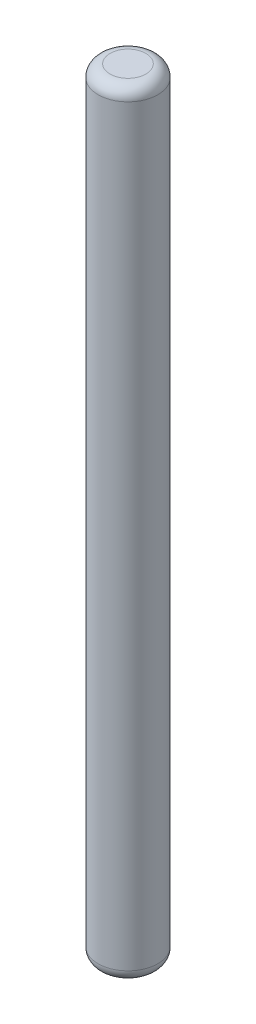
ISO-10303-21;
HEADER;
FILE_DESCRIPTION(('STEP AP214'),'2;1');
FILE_NAME('part.step','',(''),(''),'','','');
FILE_SCHEMA(('AUTOMOTIVE_DESIGN { 1 0 10303 214 1 1 1 1 }'));
ENDSEC;
DATA;
#1=APPLICATION_CONTEXT('core data for automotive mechanical design processes');
#2=APPLICATION_PROTOCOL_DEFINITION('international standard','automotive_design',2000,#1);
#3=PRODUCT_CONTEXT('',#1,'mechanical');
#4=PRODUCT('Part','Part','',(#3));
#5=PRODUCT_RELATED_PRODUCT_CATEGORY('part','',(#4));
#6=PRODUCT_DEFINITION_FORMATION('','',#4);
#7=PRODUCT_DEFINITION_CONTEXT('part definition',#1,'design');
#8=PRODUCT_DEFINITION('design','',#6,#7);
#9=PRODUCT_DEFINITION_SHAPE('','',#8);
#10=(LENGTH_UNIT() NAMED_UNIT(*) SI_UNIT(.MILLI.,.METRE.));
#11=(NAMED_UNIT(*) PLANE_ANGLE_UNIT() SI_UNIT($,.RADIAN.));
#12=(NAMED_UNIT(*) SI_UNIT($,.STERADIAN.) SOLID_ANGLE_UNIT());
#13=UNCERTAINTY_MEASURE_WITH_UNIT(LENGTH_MEASURE(1.E-05),#10,'distance_accuracy_value','');
#14=(GEOMETRIC_REPRESENTATION_CONTEXT(3) GLOBAL_UNCERTAINTY_ASSIGNED_CONTEXT((#13)) GLOBAL_UNIT_ASSIGNED_CONTEXT((#10,
#11,#12)) REPRESENTATION_CONTEXT('',''));
#15=CARTESIAN_POINT('',(0.,0.,0.));
#16=DIRECTION('',(0.,0.,1.));
#17=DIRECTION('',(1.,0.,0.));
#18=AXIS2_PLACEMENT_3D('',#15,#16,#17);
#19=CARTESIAN_POINT('',(0.0610619421206054,65.,-0.0610619421206095));
#20=DIRECTION('',(0.,-1.,0.));
#21=DIRECTION('',(0.,0.,-1.));
#22=AXIS2_PLACEMENT_3D('',#19,#20,#21);
#23=CYLINDRICAL_SURFACE('',#22,2.5);
#24=CARTESIAN_POINT('',(0.0610619421206054,1.,-0.0610619421206095));
#25=DIRECTION('',(0.,1.,0.));
#26=DIRECTION('',(0.,0.,1.));
#27=AXIS2_PLACEMENT_3D('',#24,#25,#26);
#28=CIRCLE('',#27,2.5);
#29=CARTESIAN_POINT('',(0.0610619421206054,1.,2.43893805787939));
#30=VERTEX_POINT('',#29);
#31=EDGE_CURVE('E41',#30,#30,#28,.T.);
#32=ORIENTED_EDGE('',*,*,#31,.T.);
#33=EDGE_LOOP('',(#32));
#34=FACE_BOUND('',#33,.T.);
#35=DIRECTION('',(0.,1.,0.));
#36=VECTOR('',#35,1.);
#37=CARTESIAN_POINT('',(1.1730828056927,40.,-2.30012638937986));
#38=LINE('',#37,#36);
#39=CARTESIAN_POINT('',(1.1730828056927,40.,-2.30012638937986));
#40=VERTEX_POINT('',#39);
#41=CARTESIAN_POINT('',(1.1730828056927,64.,-2.30012638937986));
#42=VERTEX_POINT('',#41);
#43=EDGE_CURVE('E73',#40,#42,#38,.T.);
#44=ORIENTED_EDGE('',*,*,#43,.T.);
#45=CARTESIAN_POINT('',(0.0610619421206054,64.,-0.0610619421206095));
#46=DIRECTION('',(0.,1.,0.));
#47=DIRECTION('',(0.,0.,1.));
#48=AXIS2_PLACEMENT_3D('',#45,#46,#47);
#49=CIRCLE('',#48,2.5);
#50=CARTESIAN_POINT('',(-1.0062591401267,64.,-2.32177548155687));
#51=VERTEX_POINT('',#50);
#52=EDGE_CURVE('E77',#42,#51,#49,.F.);
#53=ORIENTED_EDGE('',*,*,#52,.T.);
#54=DIRECTION('',(0.,1.,0.));
#55=VECTOR('',#54,1.);
#56=CARTESIAN_POINT('',(-1.0062591401267,40.,-2.32177548155687));
#57=LINE('',#56,#55);
#58=CARTESIAN_POINT('',(-1.0062591401267,40.,-2.32177548155687));
#59=VERTEX_POINT('',#58);
#60=EDGE_CURVE('E72',#59,#51,#57,.T.);
#61=ORIENTED_EDGE('',*,*,#60,.F.);
#62=CARTESIAN_POINT('',(0.0610619421206054,40.,-0.0610619421206095));
#63=DIRECTION('',(0.,1.,0.));
#64=DIRECTION('',(0.,0.,1.));
#65=AXIS2_PLACEMENT_3D('',#62,#63,#64);
#66=CIRCLE('',#65,2.5);
#67=EDGE_CURVE('E64',#40,#59,#66,.T.);
#68=ORIENTED_EDGE('',*,*,#67,.F.);
#69=EDGE_LOOP('',(#44,#53,#61,#68));
#70=FACE_BOUND('',#69,.T.);
#71=ADVANCED_FACE('F33',(#34,#70),#23,.T.);
#72=CARTESIAN_POINT('',(0.0610619421206054,65.,-0.0610619421206095));
#73=DIRECTION('',(0.,1.,0.));
#74=DIRECTION('',(0.,0.,1.));
#75=AXIS2_PLACEMENT_3D('',#72,#73,#74);
#76=PLANE('',#75);
#77=CARTESIAN_POINT('',(0.0610619421206054,65.,-0.0610619421206095));
#78=DIRECTION('',(0.,1.,0.));
#79=DIRECTION('',(0.,0.,1.));
#80=AXIS2_PLACEMENT_3D('',#77,#78,#79);
#81=CIRCLE('',#80,1.5);
#82=CARTESIAN_POINT('',(-0.57933070722778,65.,-1.41749006578237));
#83=VERTEX_POINT('',#82);
#84=EDGE_CURVE('E46',#83,#83,#81,.T.);
#85=ORIENTED_EDGE('',*,*,#84,.T.);
#86=EDGE_LOOP('',(#85));
#87=FACE_BOUND('',#86,.T.);
#88=ADVANCED_FACE('F96',(#87),#76,.T.);
#89=CARTESIAN_POINT('',(0.0610619421206054,0.,-0.0610619421206095));
#90=DIRECTION('',(0.,1.,0.));
#91=DIRECTION('',(0.,0.,1.));
#92=AXIS2_PLACEMENT_3D('',#89,#90,#91);
#93=PLANE('',#92);
#94=CARTESIAN_POINT('',(0.0610619421206054,0.,-0.0610619421206095));
#95=DIRECTION('',(0.,1.,0.));
#96=DIRECTION('',(0.,0.,1.));
#97=AXIS2_PLACEMENT_3D('',#94,#95,#96);
#98=CIRCLE('',#97,1.5);
#99=CARTESIAN_POINT('',(0.0610619421206054,0.,1.43893805787939));
#100=VERTEX_POINT('',#99);
#101=EDGE_CURVE('E11',#100,#100,#98,.F.);
#102=ORIENTED_EDGE('',*,*,#101,.T.);
#103=EDGE_LOOP('',(#102));
#104=FACE_BOUND('',#103,.T.);
#105=ADVANCED_FACE('F95',(#104),#93,.F.);
#106=CARTESIAN_POINT('',(-1.0062591401267,40.,-2.32177548155687));
#107=DIRECTION('',(-0.00993328473884208,0.,0.999950663710114));
#108=DIRECTION('',(0.999950663710114,0.,0.00993328473884209));
#109=AXIS2_PLACEMENT_3D('',#106,#107,#108);
#110=PLANE('',#109);
#111=ORIENTED_EDGE('',*,*,#60,.T.);
#112=CARTESIAN_POINT('',(-1.0062591401267,64.,-2.32177548155687));
#113=CARTESIAN_POINT('',(-1.00631033317868,64.0257499887345,-2.32177599009712));
#114=CARTESIAN_POINT('',(-1.0039810217002,64.0514506104349,-2.32175285124138));
#115=CARTESIAN_POINT('',(-0.994995752809504,64.1019040028832,-2.32166359360339));
#116=CARTESIAN_POINT('',(-0.988370552567407,64.1266621971751,-2.32159778035595));
#117=CARTESIAN_POINT('',(-0.97123444522594,64.1747163457058,-2.32142755412408));
#118=CARTESIAN_POINT('',(-0.960731452519259,64.1980151659547,-2.32132321975945));
#119=CARTESIAN_POINT('',(-0.93643118514888,64.2428520651656,-2.32108182637497));
#120=CARTESIAN_POINT('',(-0.922627961103178,64.2643868688766,-2.32094470825531));
#121=CARTESIAN_POINT('',(-0.885025735099742,64.315375503014,-2.32057117620892));
#122=CARTESIAN_POINT('',(-0.859615862734575,64.3436421887854,-2.32031876025828));
#123=CARTESIAN_POINT('',(-0.804620181817592,64.3957555623736,-2.31977244554718));
#124=CARTESIAN_POINT('',(-0.775025339542913,64.4195924233207,-2.31947845704776));
#125=CARTESIAN_POINT('',(-0.697051615138197,64.4743140168869,-2.31870388362652));
#126=CARTESIAN_POINT('',(-0.646822331847807,64.5025451452475,-2.31820491723622));
#127=CARTESIAN_POINT('',(-0.542704753328841,64.5510427446245,-2.31717063665491));
#128=CARTESIAN_POINT('',(-0.488809590600883,64.5712937556895,-2.3166352542437));
#129=CARTESIAN_POINT('',(-0.388965050704052,64.6020510013919,-2.31564342106592));
#130=CARTESIAN_POINT('',(-0.343344354841181,64.6136578492241,-2.31519023534543));
#131=CARTESIAN_POINT('',(-0.251258477705556,64.6329359116968,-2.31427547497653));
#132=CARTESIAN_POINT('',(-0.204792751425287,64.6406044858596,-2.31381389491414));
#133=CARTESIAN_POINT('',(-0.111260526632352,64.6523858278835,-2.31288476685329));
#134=CARTESIAN_POINT('',(-0.0641925183746455,64.6564863632128,-2.31241720385735));
#135=CARTESIAN_POINT('',(0.0301176718546659,64.6612889872444,-2.31148034766302));
#136=CARTESIAN_POINT('',(0.077359870038602,64.6619907511926,-2.31101105430357));
#137=CARTESIAN_POINT('',(0.174380010781724,64.6599767382401,-2.31004727807103));
#138=CARTESIAN_POINT('',(0.224154175603773,64.6570704334021,-2.30955283272511));
#139=CARTESIAN_POINT('',(0.323352322361662,64.647351465898,-2.30856742067123));
#140=CARTESIAN_POINT('',(0.372776118911912,64.640536871771,-2.30807645580483));
#141=CARTESIAN_POINT('',(0.47057786253572,64.622679375656,-2.30710491530526));
#142=CARTESIAN_POINT('',(0.518960158491438,64.6116607368836,-2.30662429647126));
#143=CARTESIAN_POINT('',(0.614344556207763,64.5848282251451,-2.30567676934163));
#144=CARTESIAN_POINT('',(0.661348379537118,64.5690206395421,-2.30520984394432));
#145=CARTESIAN_POINT('',(0.746297075132156,64.5345904604404,-2.3043659827298));
#146=CARTESIAN_POINT('',(0.784549503808907,64.5167362593022,-2.30398599171645));
#147=CARTESIAN_POINT('',(0.858625892417835,64.4763674909329,-2.30325013355146));
#148=CARTESIAN_POINT('',(0.894446849196685,64.4538472948652,-2.30289429623247));
#149=CARTESIAN_POINT('',(0.962749795088707,64.4032426767613,-2.30221579014745));
#150=CARTESIAN_POINT('',(0.995180467613998,64.3750875735631,-2.30189363114885));
#151=CARTESIAN_POINT('',(1.05402687609468,64.3130730117989,-2.30130906417719));
#152=CARTESIAN_POINT('',(1.0804648667686,64.2792354991597,-2.30104643513076));
#153=CARTESIAN_POINT('',(1.11641536563521,64.2199676123323,-2.30068931096983));
#154=CARTESIAN_POINT('',(1.12855950645761,64.1961287340362,-2.30056867380935));
#155=CARTESIAN_POINT('',(1.14877396415882,64.1467957088242,-2.30036786793814));
#156=CARTESIAN_POINT('',(1.15685102246279,64.1213043806518,-2.30028763225963));
#157=CARTESIAN_POINT('',(1.16836614027504,64.0692250321703,-2.30017324367209));
#158=CARTESIAN_POINT('',(1.17179449404148,64.0426348364314,-2.30013918717772));
#159=CARTESIAN_POINT('',(1.17379424305161,63.9890823158577,-2.30011932212133));
#160=CARTESIAN_POINT('',(1.17232996673068,63.9621186915818,-2.30013386791259));
#161=CARTESIAN_POINT('',(1.1682988411613,63.9355095828083,-2.30017391220633));
#162=B_SPLINE_CURVE_WITH_KNOTS('',3,(#112,#113,#114,#115,#116,#117,#118,#119,#120,#121,#122,
#123,#124,#125,#126,#127,#128,#129,#130,#131,#132,#133,#134,#135,#136,#137,#138,#139,#140,#141,
#142,#143,#144,#145,#146,#147,#148,#149,#150,#151,#152,#153,#154,#155,#156,#157,#158,#159,#160,
#161),.UNSPECIFIED.,.F.,.F.,(4,2,2,2,2,2,2,2,2,2,2,2,2,2,2,2,2,2,2,2,2,2,2,2,4),(0.,
0.0770663904628506,0.153587013760128,0.229952317676831,0.306456338587907,0.419841634800272,
0.533475531886061,0.705377758784605,0.877611395112667,1.01865274467184,1.15978853457695,
1.30140630401216,1.44303760481443,1.59247647297903,1.74198925694611,1.89065188562409,
2.03912017620549,2.16550593351644,2.29204505376111,2.42028398886926,2.54803858884939,
2.62799249478937,2.70781343259864,2.78780076830566,2.86837255062909),.UNSPECIFIED.);
#163=EDGE_CURVE('E53',#51,#42,#162,.T.);
#164=ORIENTED_EDGE('',*,*,#163,.T.);
#165=ORIENTED_EDGE('',*,*,#43,.F.);
#166=DIRECTION('',(0.999950663710114,0.,0.00993328473884209));
#167=VECTOR('',#166,1.);
#168=CARTESIAN_POINT('',(-1.0062591401267,40.,-2.32177548155687));
#169=LINE('',#168,#167);
#170=EDGE_CURVE('E67',#59,#40,#169,.T.);
#171=ORIENTED_EDGE('',*,*,#170,.F.);
#172=EDGE_LOOP('',(#111,#164,#165,#171));
#173=FACE_BOUND('',#172,.T.);
#174=ADVANCED_FACE('F71',(#173),#110,.F.);
#175=CARTESIAN_POINT('',(0.0610619421206054,40.,-0.0610619421206095));
#176=DIRECTION('',(0.,1.,0.));
#177=DIRECTION('',(0.,0.,1.));
#178=AXIS2_PLACEMENT_3D('',#175,#176,#177);
#179=PLANE('',#178);
#180=ORIENTED_EDGE('',*,*,#67,.T.);
#181=ORIENTED_EDGE('',*,*,#170,.T.);
#182=EDGE_LOOP('',(#180,#181));
#183=FACE_BOUND('',#182,.T.);
#184=ADVANCED_FACE('F66',(#183),#179,.T.);
#185=CARTESIAN_POINT('',(0.0610619421206054,64.,-0.0610619421206095));
#186=DIRECTION('',(0.,1.,0.));
#187=DIRECTION('',(0.,0.,1.));
#188=AXIS2_PLACEMENT_3D('',#185,#186,#187);
#189=TOROIDAL_SURFACE('',#188,1.5,1.);
#190=ORIENTED_EDGE('',*,*,#163,.F.);
#191=ORIENTED_EDGE('',*,*,#52,.F.);
#192=EDGE_LOOP('',(#190,#191));
#193=FACE_BOUND('',#192,.T.);
#194=ORIENTED_EDGE('',*,*,#84,.F.);
#195=EDGE_LOOP('',(#194));
#196=FACE_BOUND('',#195,.T.);
#197=ADVANCED_FACE('F88',(#193,#196),#189,.T.);
#198=CARTESIAN_POINT('',(0.0610619421206054,1.,-0.0610619421206095));
#199=DIRECTION('',(0.,1.,0.));
#200=DIRECTION('',(0.,0.,1.));
#201=AXIS2_PLACEMENT_3D('',#198,#199,#200);
#202=TOROIDAL_SURFACE('',#201,1.5,1.);
#203=ORIENTED_EDGE('',*,*,#101,.F.);
#204=EDGE_LOOP('',(#203));
#205=FACE_BOUND('',#204,.T.);
#206=ORIENTED_EDGE('',*,*,#31,.F.);
#207=EDGE_LOOP('',(#206));
#208=FACE_BOUND('',#207,.T.);
#209=ADVANCED_FACE('F35',(#205,#208),#202,.T.);
#210=CLOSED_SHELL('',(#71,#88,#105,#174,#184,#197,#209));
#211=MANIFOLD_SOLID_BREP('B2',#210);
#212=ADVANCED_BREP_SHAPE_REPRESENTATION('',(#18,#211),#14);
#213=SHAPE_DEFINITION_REPRESENTATION(#9,#212);
ENDSEC;
END-ISO-10303-21;
